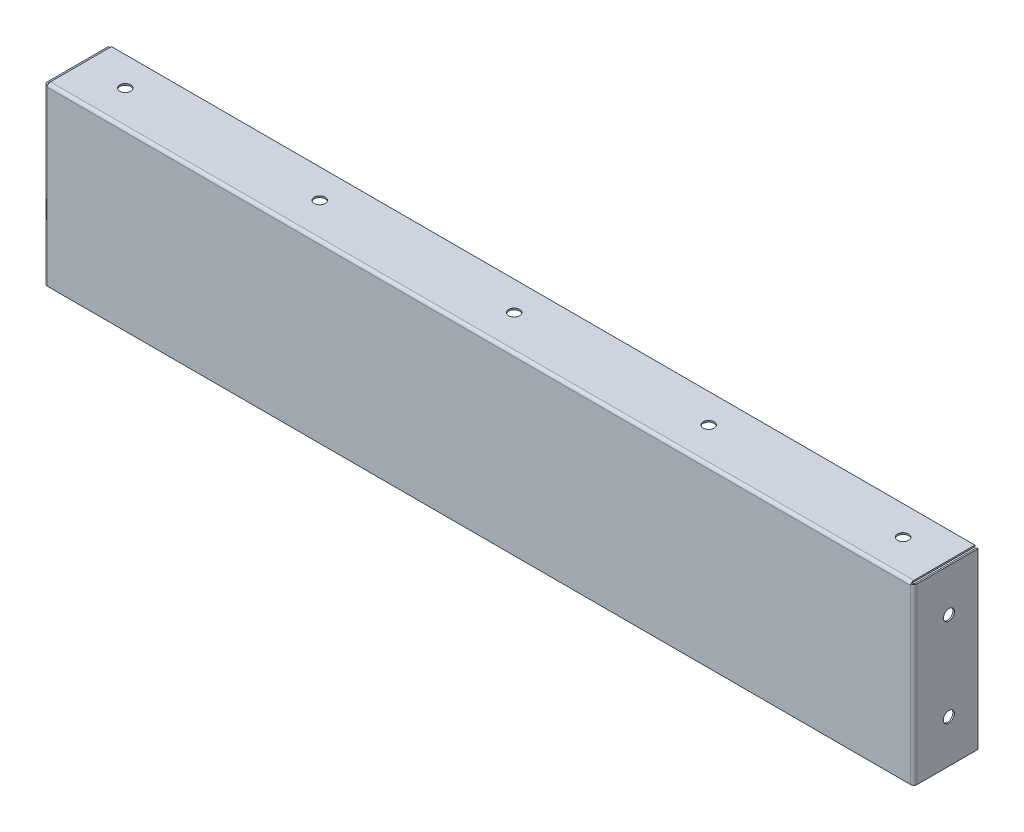
ISO-10303-21;
HEADER;
FILE_DESCRIPTION(('STEP AP214'),'2;1');
FILE_NAME('part.step','',(''),(''),'','','');
FILE_SCHEMA(('AUTOMOTIVE_DESIGN { 1 0 10303 214 1 1 1 1 }'));
ENDSEC;
DATA;
#1=APPLICATION_CONTEXT('core data for automotive mechanical design processes');
#2=APPLICATION_PROTOCOL_DEFINITION('international standard','automotive_design',2000,#1);
#3=PRODUCT_CONTEXT('',#1,'mechanical');
#4=PRODUCT('Part','Part','',(#3));
#5=PRODUCT_RELATED_PRODUCT_CATEGORY('part','',(#4));
#6=PRODUCT_DEFINITION_FORMATION('','',#4);
#7=PRODUCT_DEFINITION_CONTEXT('part definition',#1,'design');
#8=PRODUCT_DEFINITION('design','',#6,#7);
#9=PRODUCT_DEFINITION_SHAPE('','',#8);
#10=(LENGTH_UNIT() NAMED_UNIT(*) SI_UNIT(.MILLI.,.METRE.));
#11=(NAMED_UNIT(*) PLANE_ANGLE_UNIT() SI_UNIT($,.RADIAN.));
#12=(NAMED_UNIT(*) SI_UNIT($,.STERADIAN.) SOLID_ANGLE_UNIT());
#13=UNCERTAINTY_MEASURE_WITH_UNIT(LENGTH_MEASURE(1.E-05),#10,'distance_accuracy_value','');
#14=(GEOMETRIC_REPRESENTATION_CONTEXT(3) GLOBAL_UNCERTAINTY_ASSIGNED_CONTEXT((#13)) GLOBAL_UNIT_ASSIGNED_CONTEXT((#10,
#11,#12)) REPRESENTATION_CONTEXT('',''));
#15=CARTESIAN_POINT('',(0.,0.,0.));
#16=DIRECTION('',(0.,0.,1.));
#17=DIRECTION('',(1.,0.,0.));
#18=AXIS2_PLACEMENT_3D('',#15,#16,#17);
#19=CARTESIAN_POINT('',(256.286,51.6000999999999,0.685800000000012));
#20=DIRECTION('',(-1.,0.,0.));
#21=DIRECTION('',(0.,-1.,0.));
#22=AXIS2_PLACEMENT_3D('',#19,#20,#21);
#23=PLANE('',#22);
#24=DIRECTION('',(0.,0.,1.));
#25=VECTOR('',#24,1.);
#26=CARTESIAN_POINT('',(256.286,51.6000999999999,0.685800000000012));
#27=LINE('',#26,#25);
#28=CARTESIAN_POINT('',(256.286,51.6000999999999,1.35518725844096));
#29=VERTEX_POINT('',#28);
#30=CARTESIAN_POINT('',(256.286,51.6000999999999,1.60020000000001));
#31=VERTEX_POINT('',#30);
#32=EDGE_CURVE('E55',#29,#31,#27,.T.);
#33=ORIENTED_EDGE('',*,*,#32,.F.);
#34=CARTESIAN_POINT('',(256.286,50.6856999999999,-0.228599999999999));
#35=DIRECTION('',(1.,0.,0.));
#36=DIRECTION('',(0.,0.,-1.));
#37=AXIS2_PLACEMENT_3D('',#34,#35,#36);
#38=CIRCLE('',#37,1.82879999999998);
#39=CARTESIAN_POINT('',(256.286,50.6856999999999,1.60020000000001));
#40=VERTEX_POINT('',#39);
#41=EDGE_CURVE('E11',#29,#40,#38,.T.);
#42=ORIENTED_EDGE('',*,*,#41,.T.);
#43=DIRECTION('',(0.,-1.,0.));
#44=VECTOR('',#43,1.);
#45=CARTESIAN_POINT('',(256.285999999994,-51.6000999999999,1.60020000000001));
#46=LINE('',#45,#44);
#47=EDGE_CURVE('E238',#31,#40,#46,.T.);
#48=ORIENTED_EDGE('',*,*,#47,.F.);
#49=EDGE_LOOP('',(#33,#42,#48));
#50=FACE_BOUND('',#49,.T.);
#51=ADVANCED_FACE('F38',(#50),#23,.T.);
#52=CARTESIAN_POINT('',(-256.286,50.6856999999999,0.685799999999998));
#53=DIRECTION('',(1.,3.64246399155242E-13,0.));
#54=DIRECTION('',(-3.64246399155242E-13,1.,0.));
#55=AXIS2_PLACEMENT_3D('',#52,#53,#54);
#56=PLANE('',#55);
#57=DIRECTION('',(0.,1.,0.));
#58=VECTOR('',#57,1.);
#59=CARTESIAN_POINT('',(-256.286,51.6000999999999,1.60020000000001));
#60=LINE('',#59,#58);
#61=CARTESIAN_POINT('',(-256.286,51.6000999999999,1.60020000000001));
#62=VERTEX_POINT('',#61);
#63=CARTESIAN_POINT('',(-256.286,50.6856999999999,1.60020000000001));
#64=VERTEX_POINT('',#63);
#65=EDGE_CURVE('E292',#62,#64,#60,.F.);
#66=ORIENTED_EDGE('',*,*,#65,.T.);
#67=CARTESIAN_POINT('',(-256.286,50.6856999999999,-0.228599999999984));
#68=DIRECTION('',(1.,0.,0.));
#69=DIRECTION('',(0.,0.,-1.));
#70=AXIS2_PLACEMENT_3D('',#67,#68,#69);
#71=CIRCLE('',#70,1.82879999999998);
#72=CARTESIAN_POINT('',(-256.286,51.6000999999999,1.35518725844099));
#73=VERTEX_POINT('',#72);
#74=EDGE_CURVE('E227',#64,#73,#71,.F.);
#75=ORIENTED_EDGE('',*,*,#74,.T.);
#76=DIRECTION('',(0.,0.,1.));
#77=VECTOR('',#76,1.);
#78=CARTESIAN_POINT('',(-256.286,51.6000999999999,0.685800000000012));
#79=LINE('',#78,#77);
#80=EDGE_CURVE('E298',#73,#62,#79,.T.);
#81=ORIENTED_EDGE('',*,*,#80,.T.);
#82=EDGE_LOOP('',(#66,#75,#81));
#83=FACE_BOUND('',#82,.T.);
#84=ADVANCED_FACE('F441',(#83),#56,.T.);
#85=CARTESIAN_POINT('',(0.,0.,1.6002));
#86=DIRECTION('',(0.,0.,-1.));
#87=DIRECTION('',(-1.,0.,0.));
#88=AXIS2_PLACEMENT_3D('',#85,#86,#87);
#89=PLANE('',#88);
#90=DIRECTION('',(1.,0.,0.));
#91=VECTOR('',#90,1.);
#92=CARTESIAN_POINT('',(256.286,50.6856999999999,1.60019999999998));
#93=LINE('',#92,#91);
#94=EDGE_CURVE('E181',#40,#64,#93,.F.);
#95=ORIENTED_EDGE('',*,*,#94,.T.);
#96=CARTESIAN_POINT('',(-256.286,-51.6000999999999,1.6002));
#97=VERTEX_POINT('',#96);
#98=EDGE_CURVE('E295',#64,#97,#60,.F.);
#99=ORIENTED_EDGE('',*,*,#98,.T.);
#100=DIRECTION('',(1.,0.,0.));
#101=VECTOR('',#100,1.);
#102=CARTESIAN_POINT('',(-257.2004,-51.6000999999999,1.6002));
#103=LINE('',#102,#101);
#104=CARTESIAN_POINT('',(256.286,-51.6000999999999,1.60020000000001));
#105=VERTEX_POINT('',#104);
#106=EDGE_CURVE('E47',#97,#105,#103,.T.);
#107=ORIENTED_EDGE('',*,*,#106,.T.);
#108=DIRECTION('',(0.,-1.,0.));
#109=VECTOR('',#108,1.);
#110=CARTESIAN_POINT('',(256.286,-51.6000999999999,1.60020000000001));
#111=LINE('',#110,#109);
#112=EDGE_CURVE('E346',#105,#40,#111,.F.);
#113=ORIENTED_EDGE('',*,*,#112,.T.);
#114=EDGE_LOOP('',(#95,#99,#107,#113));
#115=FACE_BOUND('',#114,.T.);
#116=ADVANCED_FACE('F446',(#115),#89,.F.);
#117=CARTESIAN_POINT('',(0.,0.,0.6858));
#118=DIRECTION('',(0.,0.,-1.));
#119=DIRECTION('',(-1.,0.,0.));
#120=AXIS2_PLACEMENT_3D('',#117,#118,#119);
#121=PLANE('',#120);
#122=DIRECTION('',(0.,1.,0.));
#123=VECTOR('',#122,1.);
#124=CARTESIAN_POINT('',(-256.286,51.6000999999999,0.685800000000012));
#125=LINE('',#124,#123);
#126=CARTESIAN_POINT('',(-256.286,50.6856999999999,0.685800000000012));
#127=VERTEX_POINT('',#126);
#128=CARTESIAN_POINT('',(-256.286,-51.6000999999999,0.685800000000012));
#129=VERTEX_POINT('',#128);
#130=EDGE_CURVE('E63',#127,#129,#125,.F.);
#131=ORIENTED_EDGE('',*,*,#130,.F.);
#132=DIRECTION('',(1.,0.,0.));
#133=VECTOR('',#132,1.);
#134=CARTESIAN_POINT('',(256.286,50.6856999999999,0.685799999999982));
#135=LINE('',#134,#133);
#136=CARTESIAN_POINT('',(256.286,50.6856999999999,0.685799999999982));
#137=VERTEX_POINT('',#136);
#138=EDGE_CURVE('E233',#137,#127,#135,.F.);
#139=ORIENTED_EDGE('',*,*,#138,.F.);
#140=DIRECTION('',(0.,-1.,0.));
#141=VECTOR('',#140,1.);
#142=CARTESIAN_POINT('',(256.286,-51.6000999999999,0.685800000000012));
#143=LINE('',#142,#141);
#144=CARTESIAN_POINT('',(256.286,-51.6000999999999,0.6858));
#145=VERTEX_POINT('',#144);
#146=EDGE_CURVE('E359',#145,#137,#143,.F.);
#147=ORIENTED_EDGE('',*,*,#146,.F.);
#148=DIRECTION('',(-1.,0.,0.));
#149=VECTOR('',#148,1.);
#150=CARTESIAN_POINT('',(0.,-51.6000999999999,0.6858));
#151=LINE('',#150,#149);
#152=EDGE_CURVE('E366',#129,#145,#151,.F.);
#153=ORIENTED_EDGE('',*,*,#152,.F.);
#154=EDGE_LOOP('',(#131,#139,#147,#153));
#155=FACE_BOUND('',#154,.T.);
#156=ADVANCED_FACE('F534',(#155),#121,.T.);
#157=CARTESIAN_POINT('',(-257.2004,-51.6000999999999,1.6002));
#158=DIRECTION('',(0.,1.,0.));
#159=DIRECTION('',(1.,0.,0.));
#160=AXIS2_PLACEMENT_3D('',#157,#158,#159);
#161=PLANE('',#160);
#162=DIRECTION('',(0.,0.,1.));
#163=VECTOR('',#162,1.);
#164=CARTESIAN_POINT('',(-256.286,-51.6000999999999,0.685800000000012));
#165=LINE('',#164,#163);
#166=EDGE_CURVE('E309',#129,#97,#165,.T.);
#167=ORIENTED_EDGE('',*,*,#166,.F.);
#168=ORIENTED_EDGE('',*,*,#152,.T.);
#169=DIRECTION('',(0.,0.,1.));
#170=VECTOR('',#169,1.);
#171=CARTESIAN_POINT('',(256.286,-51.6000999999999,0.685800000000012));
#172=LINE('',#171,#170);
#173=EDGE_CURVE('E353',#145,#105,#172,.T.);
#174=ORIENTED_EDGE('',*,*,#173,.T.);
#175=ORIENTED_EDGE('',*,*,#106,.F.);
#176=EDGE_LOOP('',(#167,#168,#174,#175));
#177=FACE_BOUND('',#176,.T.);
#178=ADVANCED_FACE('F40',(#177),#161,.F.);
#179=CARTESIAN_POINT('',(256.286,51.6000999999999,-0.22859999999997));
#180=DIRECTION('',(0.,1.,0.));
#181=DIRECTION('',(0.,0.,1.));
#182=AXIS2_PLACEMENT_3D('',#179,#180,#181);
#183=PLANE('',#182);
#184=DIRECTION('',(1.,0.,0.));
#185=VECTOR('',#184,1.);
#186=CARTESIAN_POINT('',(257.2004,51.6000999999999,-0.228599999999968));
#187=LINE('',#186,#185);
#188=CARTESIAN_POINT('',(257.2004,51.6000999999999,-0.228599999999968));
#189=VERTEX_POINT('',#188);
#190=CARTESIAN_POINT('',(258.1148,51.6000999999999,-0.228599999999965));
#191=VERTEX_POINT('',#190);
#192=EDGE_CURVE('E312',#189,#191,#187,.T.);
#193=ORIENTED_EDGE('',*,*,#192,.F.);
#194=CARTESIAN_POINT('',(256.286,51.6000999999999,-0.22859999999997));
#195=DIRECTION('',(0.,-1.,0.));
#196=DIRECTION('',(0.,0.,-1.));
#197=AXIS2_PLACEMENT_3D('',#194,#195,#196);
#198=CIRCLE('',#197,0.914399999999982);
#199=CARTESIAN_POINT('',(256.286,51.6000999999999,0.685800000000012));
#200=VERTEX_POINT('',#199);
#201=EDGE_CURVE('E356',#200,#189,#198,.F.);
#202=ORIENTED_EDGE('',*,*,#201,.F.);
#203=EDGE_CURVE('E364',#200,#29,#27,.T.);
#204=ORIENTED_EDGE('',*,*,#203,.T.);
#205=ORIENTED_EDGE('',*,*,#32,.T.);
#206=CARTESIAN_POINT('',(256.286,51.6000999999999,-0.22859999999997));
#207=DIRECTION('',(0.,-1.,0.));
#208=DIRECTION('',(0.,0.,-1.));
#209=AXIS2_PLACEMENT_3D('',#206,#207,#208);
#210=CIRCLE('',#209,1.82879999999998);
#211=EDGE_CURVE('E349',#31,#191,#210,.F.);
#212=ORIENTED_EDGE('',*,*,#211,.T.);
#213=EDGE_LOOP('',(#193,#202,#204,#205,#212));
#214=FACE_BOUND('',#213,.T.);
#215=ADVANCED_FACE('F526',(#214),#183,.T.);
#216=CARTESIAN_POINT('',(256.286,-51.6000999999999,-0.22859999999997));
#217=DIRECTION('',(0.,1.,0.));
#218=DIRECTION('',(0.,0.,1.));
#219=AXIS2_PLACEMENT_3D('',#216,#217,#218);
#220=PLANE('',#219);
#221=CARTESIAN_POINT('',(256.286,-51.6000999999999,-0.22859999999997));
#222=DIRECTION('',(0.,-1.,0.));
#223=DIRECTION('',(0.,0.,-1.));
#224=AXIS2_PLACEMENT_3D('',#221,#222,#223);
#225=CIRCLE('',#224,0.914399999999982);
#226=CARTESIAN_POINT('',(257.2004,-51.6000999999999,-0.228599999999968));
#227=VERTEX_POINT('',#226);
#228=EDGE_CURVE('E345',#227,#145,#225,.T.);
#229=ORIENTED_EDGE('',*,*,#228,.F.);
#230=DIRECTION('',(1.,0.,0.));
#231=VECTOR('',#230,1.);
#232=CARTESIAN_POINT('',(257.2004,-51.6000999999999,-0.228599999999968));
#233=LINE('',#232,#231);
#234=CARTESIAN_POINT('',(258.1148,-51.6000999999999,-0.228599999999965));
#235=VERTEX_POINT('',#234);
#236=EDGE_CURVE('E318',#227,#235,#233,.T.);
#237=ORIENTED_EDGE('',*,*,#236,.T.);
#238=CARTESIAN_POINT('',(256.286,-51.6000999999999,-0.22859999999997));
#239=DIRECTION('',(0.,-1.,0.));
#240=DIRECTION('',(0.,0.,-1.));
#241=AXIS2_PLACEMENT_3D('',#238,#239,#240);
#242=CIRCLE('',#241,1.82879999999998);
#243=EDGE_CURVE('E350',#235,#105,#242,.T.);
#244=ORIENTED_EDGE('',*,*,#243,.T.);
#245=ORIENTED_EDGE('',*,*,#173,.F.);
#246=EDGE_LOOP('',(#229,#237,#244,#245));
#247=FACE_BOUND('',#246,.T.);
#248=ADVANCED_FACE('F521',(#247),#220,.F.);
#249=CARTESIAN_POINT('',(256.286,-51.6000999999999,-0.22859999999997));
#250=DIRECTION('',(0.,-1.,0.));
#251=DIRECTION('',(1.,0.,0.));
#252=AXIS2_PLACEMENT_3D('',#249,#250,#251);
#253=CYLINDRICAL_SURFACE('',#252,1.82879999999998);
#254=ORIENTED_EDGE('',*,*,#112,.F.);
#255=ORIENTED_EDGE('',*,*,#243,.F.);
#256=DIRECTION('',(0.,1.,0.));
#257=VECTOR('',#256,1.);
#258=CARTESIAN_POINT('',(258.1148,0.,-0.228599999999965));
#259=LINE('',#258,#257);
#260=EDGE_CURVE('E321',#235,#191,#259,.T.);
#261=ORIENTED_EDGE('',*,*,#260,.T.);
#262=ORIENTED_EDGE('',*,*,#211,.F.);
#263=ORIENTED_EDGE('',*,*,#47,.T.);
#264=EDGE_LOOP('',(#254,#255,#261,#262,#263));
#265=FACE_BOUND('',#264,.T.);
#266=ADVANCED_FACE('F518',(#265),#253,.T.);
#267=CARTESIAN_POINT('',(256.286,-51.6000999999999,-0.22859999999997));
#268=DIRECTION('',(0.,-1.,0.));
#269=DIRECTION('',(1.,0.,0.));
#270=AXIS2_PLACEMENT_3D('',#267,#268,#269);
#271=CYLINDRICAL_SURFACE('',#270,0.914399999999982);
#272=ORIENTED_EDGE('',*,*,#146,.T.);
#273=DIRECTION('',(0.,-1.,0.));
#274=VECTOR('',#273,1.);
#275=CARTESIAN_POINT('',(256.286,51.6000999999999,0.685800000000012));
#276=LINE('',#275,#274);
#277=EDGE_CURVE('E229',#200,#137,#276,.T.);
#278=ORIENTED_EDGE('',*,*,#277,.F.);
#279=ORIENTED_EDGE('',*,*,#201,.T.);
#280=DIRECTION('',(0.,-1.,0.));
#281=VECTOR('',#280,1.);
#282=CARTESIAN_POINT('',(257.2004,51.6000999999999,-0.228599999999968));
#283=LINE('',#282,#281);
#284=EDGE_CURVE('E316',#189,#227,#283,.T.);
#285=ORIENTED_EDGE('',*,*,#284,.T.);
#286=ORIENTED_EDGE('',*,*,#228,.T.);
#287=EDGE_LOOP('',(#272,#278,#279,#285,#286));
#288=FACE_BOUND('',#287,.T.);
#289=ADVANCED_FACE('F516',(#288),#271,.F.);
#290=CARTESIAN_POINT('',(258.1148,-51.6000999999999,-36.4998));
#291=DIRECTION('',(0.,1.,0.));
#292=DIRECTION('',(0.,0.,1.));
#293=AXIS2_PLACEMENT_3D('',#290,#291,#292);
#294=PLANE('',#293);
#295=ORIENTED_EDGE('',*,*,#236,.F.);
#296=DIRECTION('',(0.,0.,-1.));
#297=VECTOR('',#296,1.);
#298=CARTESIAN_POINT('',(257.2004,-51.6000999999999,-36.4998));
#299=LINE('',#298,#297);
#300=CARTESIAN_POINT('',(257.2004,-51.6000999999999,-36.4998));
#301=VERTEX_POINT('',#300);
#302=EDGE_CURVE('E325',#227,#301,#299,.T.);
#303=ORIENTED_EDGE('',*,*,#302,.T.);
#304=DIRECTION('',(-1.,0.,0.));
#305=VECTOR('',#304,1.);
#306=CARTESIAN_POINT('',(258.1148,-51.6000999999999,-36.4998));
#307=LINE('',#306,#305);
#308=CARTESIAN_POINT('',(258.1148,-51.6000999999999,-36.4998));
#309=VERTEX_POINT('',#308);
#310=EDGE_CURVE('E342',#309,#301,#307,.T.);
#311=ORIENTED_EDGE('',*,*,#310,.F.);
#312=DIRECTION('',(0.,0.,-1.));
#313=VECTOR('',#312,1.);
#314=CARTESIAN_POINT('',(258.1148,-51.6000999999999,-36.4998));
#315=LINE('',#314,#313);
#316=EDGE_CURVE('E326',#235,#309,#315,.T.);
#317=ORIENTED_EDGE('',*,*,#316,.F.);
#318=EDGE_LOOP('',(#295,#303,#311,#317));
#319=FACE_BOUND('',#318,.T.);
#320=ADVANCED_FACE('F509',(#319),#294,.F.);
#321=CARTESIAN_POINT('',(258.1148,51.6000999999999,0.685800000000003));
#322=DIRECTION('',(0.,-1.,0.));
#323=DIRECTION('',(0.,0.,-1.));
#324=AXIS2_PLACEMENT_3D('',#321,#322,#323);
#325=PLANE('',#324);
#326=ORIENTED_EDGE('',*,*,#192,.T.);
#327=DIRECTION('',(0.,0.,1.));
#328=VECTOR('',#327,1.);
#329=CARTESIAN_POINT('',(258.1148,51.6000999999999,0.685800000000003));
#330=LINE('',#329,#328);
#331=CARTESIAN_POINT('',(258.1148,51.6000999999999,-36.4998));
#332=VERTEX_POINT('',#331);
#333=EDGE_CURVE('E331',#332,#191,#330,.T.);
#334=ORIENTED_EDGE('',*,*,#333,.F.);
#335=DIRECTION('',(-1.,0.,0.));
#336=VECTOR('',#335,1.);
#337=CARTESIAN_POINT('',(258.1148,51.6000999999999,-36.4998));
#338=LINE('',#337,#336);
#339=CARTESIAN_POINT('',(257.2004,51.6000999999999,-36.4998));
#340=VERTEX_POINT('',#339);
#341=EDGE_CURVE('E334',#332,#340,#338,.T.);
#342=ORIENTED_EDGE('',*,*,#341,.T.);
#343=DIRECTION('',(0.,0.,1.));
#344=VECTOR('',#343,1.);
#345=CARTESIAN_POINT('',(257.2004,51.6000999999999,0.6858));
#346=LINE('',#345,#344);
#347=EDGE_CURVE('E329',#340,#189,#346,.T.);
#348=ORIENTED_EDGE('',*,*,#347,.T.);
#349=EDGE_LOOP('',(#326,#334,#342,#348));
#350=FACE_BOUND('',#349,.T.);
#351=ADVANCED_FACE('F502',(#350),#325,.F.);
#352=CARTESIAN_POINT('',(258.1148,0.,7.71096869235304E-13));
#353=DIRECTION('',(-1.,0.,0.));
#354=DIRECTION('',(0.,0.,1.));
#355=AXIS2_PLACEMENT_3D('',#352,#353,#354);
#356=PLANE('',#355);
#357=CARTESIAN_POINT('',(258.1148,26.2000999999999,-19.2447292607018));
#358=DIRECTION('',(-1.,0.,0.));
#359=DIRECTION('',(0.,0.,1.));
#360=AXIS2_PLACEMENT_3D('',#357,#358,#359);
#361=CIRCLE('',#360,3.2639);
#362=CARTESIAN_POINT('',(258.1148,26.2000999999999,-15.9808292607018));
#363=VERTEX_POINT('',#362);
#364=EDGE_CURVE('E242',#363,#363,#361,.T.);
#365=ORIENTED_EDGE('',*,*,#364,.T.);
#366=EDGE_LOOP('',(#365));
#367=FACE_BOUND('',#366,.T.);
#368=CARTESIAN_POINT('',(258.1148,-26.2000999999999,-19.2447292607018));
#369=DIRECTION('',(-1.,0.,0.));
#370=DIRECTION('',(0.,0.,1.));
#371=AXIS2_PLACEMENT_3D('',#368,#369,#370);
#372=CIRCLE('',#371,3.2639);
#373=CARTESIAN_POINT('',(258.1148,-26.2000999999999,-15.9808292607018));
#374=VERTEX_POINT('',#373);
#375=EDGE_CURVE('E241',#374,#374,#372,.T.);
#376=ORIENTED_EDGE('',*,*,#375,.T.);
#377=EDGE_LOOP('',(#376));
#378=FACE_BOUND('',#377,.T.);
#379=ORIENTED_EDGE('',*,*,#260,.F.);
#380=ORIENTED_EDGE('',*,*,#316,.T.);
#381=DIRECTION('',(0.,1.,0.));
#382=VECTOR('',#381,1.);
#383=CARTESIAN_POINT('',(258.1148,51.6000999999999,-36.4998));
#384=LINE('',#383,#382);
#385=EDGE_CURVE('E328',#309,#332,#384,.T.);
#386=ORIENTED_EDGE('',*,*,#385,.T.);
#387=ORIENTED_EDGE('',*,*,#333,.T.);
#388=EDGE_LOOP('',(#379,#380,#386,#387));
#389=FACE_BOUND('',#388,.T.);
#390=ADVANCED_FACE('F498',(#367,#378,#389),#356,.F.);
#391=CARTESIAN_POINT('',(257.2004,0.,7.67904258699066E-13));
#392=DIRECTION('',(-1.,0.,0.));
#393=DIRECTION('',(0.,0.,1.));
#394=AXIS2_PLACEMENT_3D('',#391,#392,#393);
#395=PLANE('',#394);
#396=CARTESIAN_POINT('',(257.2004,26.2000999999999,-19.2447292607018));
#397=DIRECTION('',(-1.,0.,0.));
#398=DIRECTION('',(0.,0.,1.));
#399=AXIS2_PLACEMENT_3D('',#396,#397,#398);
#400=CIRCLE('',#399,3.2639);
#401=CARTESIAN_POINT('',(257.2004,26.2000999999999,-15.9808292607018));
#402=VERTEX_POINT('',#401);
#403=EDGE_CURVE('E258',#402,#402,#400,.T.);
#404=ORIENTED_EDGE('',*,*,#403,.F.);
#405=EDGE_LOOP('',(#404));
#406=FACE_BOUND('',#405,.T.);
#407=CARTESIAN_POINT('',(257.2004,-26.2000999999999,-19.2447292607018));
#408=DIRECTION('',(-1.,0.,0.));
#409=DIRECTION('',(0.,0.,1.));
#410=AXIS2_PLACEMENT_3D('',#407,#408,#409);
#411=CIRCLE('',#410,3.2639);
#412=CARTESIAN_POINT('',(257.2004,-26.2000999999999,-15.9808292607018));
#413=VERTEX_POINT('',#412);
#414=EDGE_CURVE('E251',#413,#413,#411,.T.);
#415=ORIENTED_EDGE('',*,*,#414,.F.);
#416=EDGE_LOOP('',(#415));
#417=FACE_BOUND('',#416,.T.);
#418=ORIENTED_EDGE('',*,*,#302,.F.);
#419=ORIENTED_EDGE('',*,*,#284,.F.);
#420=ORIENTED_EDGE('',*,*,#347,.F.);
#421=DIRECTION('',(0.,1.,0.));
#422=VECTOR('',#421,1.);
#423=CARTESIAN_POINT('',(257.2004,51.6000999999999,-36.4998));
#424=LINE('',#423,#422);
#425=EDGE_CURVE('E336',#301,#340,#424,.T.);
#426=ORIENTED_EDGE('',*,*,#425,.F.);
#427=EDGE_LOOP('',(#418,#419,#420,#426));
#428=FACE_BOUND('',#427,.T.);
#429=ADVANCED_FACE('F501',(#406,#417,#428),#395,.T.);
#430=CARTESIAN_POINT('',(258.1148,51.6000999999999,-36.4998));
#431=DIRECTION('',(0.,0.,1.));
#432=DIRECTION('',(1.,0.,0.));
#433=AXIS2_PLACEMENT_3D('',#430,#431,#432);
#434=PLANE('',#433);
#435=ORIENTED_EDGE('',*,*,#425,.T.);
#436=ORIENTED_EDGE('',*,*,#341,.F.);
#437=ORIENTED_EDGE('',*,*,#385,.F.);
#438=ORIENTED_EDGE('',*,*,#310,.T.);
#439=EDGE_LOOP('',(#435,#436,#437,#438));
#440=FACE_BOUND('',#439,.T.);
#441=ADVANCED_FACE('F493',(#440),#434,.F.);
#442=CARTESIAN_POINT('',(-256.286,-51.6000999999999,-0.22859999999997));
#443=DIRECTION('',(0.,-1.,0.));
#444=DIRECTION('',(0.,0.,-1.));
#445=AXIS2_PLACEMENT_3D('',#442,#443,#444);
#446=PLANE('',#445);
#447=DIRECTION('',(-1.,0.,0.));
#448=VECTOR('',#447,1.);
#449=CARTESIAN_POINT('',(-257.2004,-51.6000999999999,-0.228599999999968));
#450=LINE('',#449,#448);
#451=CARTESIAN_POINT('',(-257.2004,-51.6000999999999,-0.228599999999968));
#452=VERTEX_POINT('',#451);
#453=CARTESIAN_POINT('',(-258.1148,-51.6000999999999,-0.228599999999965));
#454=VERTEX_POINT('',#453);
#455=EDGE_CURVE('E261',#452,#454,#450,.T.);
#456=ORIENTED_EDGE('',*,*,#455,.F.);
#457=CARTESIAN_POINT('',(-256.286,-51.6000999999999,-0.22859999999997));
#458=DIRECTION('',(0.,1.,0.));
#459=DIRECTION('',(0.,0.,1.));
#460=AXIS2_PLACEMENT_3D('',#457,#458,#459);
#461=CIRCLE('',#460,0.914399999999982);
#462=EDGE_CURVE('E302',#129,#452,#461,.F.);
#463=ORIENTED_EDGE('',*,*,#462,.F.);
#464=ORIENTED_EDGE('',*,*,#166,.T.);
#465=CARTESIAN_POINT('',(-256.286,-51.6000999999999,-0.22859999999997));
#466=DIRECTION('',(0.,1.,0.));
#467=DIRECTION('',(0.,0.,1.));
#468=AXIS2_PLACEMENT_3D('',#465,#466,#467);
#469=CIRCLE('',#468,1.82879999999998);
#470=EDGE_CURVE('E294',#97,#454,#469,.F.);
#471=ORIENTED_EDGE('',*,*,#470,.T.);
#472=EDGE_LOOP('',(#456,#463,#464,#471));
#473=FACE_BOUND('',#472,.T.);
#474=ADVANCED_FACE('F490',(#473),#446,.T.);
#475=CARTESIAN_POINT('',(-256.286,51.6000999999999,-0.22859999999997));
#476=DIRECTION('',(0.,-1.,0.));
#477=DIRECTION('',(0.,0.,-1.));
#478=AXIS2_PLACEMENT_3D('',#475,#476,#477);
#479=PLANE('',#478);
#480=CARTESIAN_POINT('',(-256.286,51.6000999999999,-0.22859999999997));
#481=DIRECTION('',(0.,1.,0.));
#482=DIRECTION('',(0.,0.,1.));
#483=AXIS2_PLACEMENT_3D('',#480,#481,#482);
#484=CIRCLE('',#483,0.914399999999982);
#485=CARTESIAN_POINT('',(-257.2004,51.6000999999999,-0.228599999999968));
#486=VERTEX_POINT('',#485);
#487=CARTESIAN_POINT('',(-256.286,51.6000999999999,0.685800000000012));
#488=VERTEX_POINT('',#487);
#489=EDGE_CURVE('E291',#486,#488,#484,.T.);
#490=ORIENTED_EDGE('',*,*,#489,.F.);
#491=DIRECTION('',(-1.,0.,0.));
#492=VECTOR('',#491,1.);
#493=CARTESIAN_POINT('',(-257.2004,51.6000999999999,-0.228599999999968));
#494=LINE('',#493,#492);
#495=CARTESIAN_POINT('',(-258.1148,51.6000999999999,-0.228599999999965));
#496=VERTEX_POINT('',#495);
#497=EDGE_CURVE('E264',#486,#496,#494,.T.);
#498=ORIENTED_EDGE('',*,*,#497,.T.);
#499=CARTESIAN_POINT('',(-256.286,51.6000999999999,-0.22859999999997));
#500=DIRECTION('',(0.,1.,0.));
#501=DIRECTION('',(0.,0.,1.));
#502=AXIS2_PLACEMENT_3D('',#499,#500,#501);
#503=CIRCLE('',#502,1.82879999999998);
#504=EDGE_CURVE('E299',#496,#62,#503,.T.);
#505=ORIENTED_EDGE('',*,*,#504,.T.);
#506=ORIENTED_EDGE('',*,*,#80,.F.);
#507=EDGE_CURVE('E313',#488,#73,#79,.T.);
#508=ORIENTED_EDGE('',*,*,#507,.F.);
#509=EDGE_LOOP('',(#490,#498,#505,#506,#508));
#510=FACE_BOUND('',#509,.T.);
#511=ADVANCED_FACE('F485',(#510),#479,.F.);
#512=CARTESIAN_POINT('',(-256.286,51.6000999999999,-0.22859999999997));
#513=DIRECTION('',(0.,1.,0.));
#514=DIRECTION('',(-1.,0.,0.));
#515=AXIS2_PLACEMENT_3D('',#512,#513,#514);
#516=CYLINDRICAL_SURFACE('',#515,1.82879999999998);
#517=ORIENTED_EDGE('',*,*,#65,.F.);
#518=ORIENTED_EDGE('',*,*,#504,.F.);
#519=DIRECTION('',(0.,-1.,0.));
#520=VECTOR('',#519,1.);
#521=CARTESIAN_POINT('',(-258.1148,0.,-0.228599999999965));
#522=LINE('',#521,#520);
#523=EDGE_CURVE('E267',#496,#454,#522,.T.);
#524=ORIENTED_EDGE('',*,*,#523,.T.);
#525=ORIENTED_EDGE('',*,*,#470,.F.);
#526=ORIENTED_EDGE('',*,*,#98,.F.);
#527=EDGE_LOOP('',(#517,#518,#524,#525,#526));
#528=FACE_BOUND('',#527,.T.);
#529=ADVANCED_FACE('F482',(#528),#516,.T.);
#530=CARTESIAN_POINT('',(-256.286,51.6000999999999,-0.22859999999997));
#531=DIRECTION('',(0.,1.,0.));
#532=DIRECTION('',(-1.,0.,0.));
#533=AXIS2_PLACEMENT_3D('',#530,#531,#532);
#534=CYLINDRICAL_SURFACE('',#533,0.914399999999982);
#535=EDGE_CURVE('E305',#488,#127,#125,.F.);
#536=ORIENTED_EDGE('',*,*,#535,.T.);
#537=ORIENTED_EDGE('',*,*,#130,.T.);
#538=ORIENTED_EDGE('',*,*,#462,.T.);
#539=DIRECTION('',(0.,1.,0.));
#540=VECTOR('',#539,1.);
#541=CARTESIAN_POINT('',(-257.2004,-51.6000999999999,-0.228599999999968));
#542=LINE('',#541,#540);
#543=EDGE_CURVE('E262',#452,#486,#542,.T.);
#544=ORIENTED_EDGE('',*,*,#543,.T.);
#545=ORIENTED_EDGE('',*,*,#489,.T.);
#546=EDGE_LOOP('',(#536,#537,#538,#544,#545));
#547=FACE_BOUND('',#546,.T.);
#548=ADVANCED_FACE('F480',(#547),#534,.F.);
#549=CARTESIAN_POINT('',(-258.1148,51.6000999999999,-36.4998));
#550=DIRECTION('',(0.,-1.,0.));
#551=DIRECTION('',(0.,0.,-1.));
#552=AXIS2_PLACEMENT_3D('',#549,#550,#551);
#553=PLANE('',#552);
#554=ORIENTED_EDGE('',*,*,#497,.F.);
#555=DIRECTION('',(0.,0.,-1.));
#556=VECTOR('',#555,1.);
#557=CARTESIAN_POINT('',(-257.2004,51.6000999999999,-36.4998));
#558=LINE('',#557,#556);
#559=CARTESIAN_POINT('',(-257.2004,51.6000999999999,-36.4998));
#560=VERTEX_POINT('',#559);
#561=EDGE_CURVE('E271',#486,#560,#558,.T.);
#562=ORIENTED_EDGE('',*,*,#561,.T.);
#563=DIRECTION('',(1.,0.,0.));
#564=VECTOR('',#563,1.);
#565=CARTESIAN_POINT('',(-258.1148,51.6000999999999,-36.4998));
#566=LINE('',#565,#564);
#567=CARTESIAN_POINT('',(-258.1148,51.6000999999999,-36.4998));
#568=VERTEX_POINT('',#567);
#569=EDGE_CURVE('E288',#568,#560,#566,.T.);
#570=ORIENTED_EDGE('',*,*,#569,.F.);
#571=DIRECTION('',(0.,0.,-1.));
#572=VECTOR('',#571,1.);
#573=CARTESIAN_POINT('',(-258.1148,51.6000999999999,-36.4998));
#574=LINE('',#573,#572);
#575=EDGE_CURVE('E272',#496,#568,#574,.T.);
#576=ORIENTED_EDGE('',*,*,#575,.F.);
#577=EDGE_LOOP('',(#554,#562,#570,#576));
#578=FACE_BOUND('',#577,.T.);
#579=ADVANCED_FACE('F473',(#578),#553,.F.);
#580=CARTESIAN_POINT('',(-258.1148,-51.6000999999999,0.685800000000003));
#581=DIRECTION('',(0.,1.,0.));
#582=DIRECTION('',(0.,0.,1.));
#583=AXIS2_PLACEMENT_3D('',#580,#581,#582);
#584=PLANE('',#583);
#585=ORIENTED_EDGE('',*,*,#455,.T.);
#586=DIRECTION('',(0.,0.,1.));
#587=VECTOR('',#586,1.);
#588=CARTESIAN_POINT('',(-258.1148,-51.6000999999999,0.685800000000003));
#589=LINE('',#588,#587);
#590=CARTESIAN_POINT('',(-258.1148,-51.6000999999999,-36.4998));
#591=VERTEX_POINT('',#590);
#592=EDGE_CURVE('E277',#591,#454,#589,.T.);
#593=ORIENTED_EDGE('',*,*,#592,.F.);
#594=DIRECTION('',(1.,0.,0.));
#595=VECTOR('',#594,1.);
#596=CARTESIAN_POINT('',(-258.1148,-51.6000999999999,-36.4998));
#597=LINE('',#596,#595);
#598=CARTESIAN_POINT('',(-257.2004,-51.6000999999999,-36.4998));
#599=VERTEX_POINT('',#598);
#600=EDGE_CURVE('E280',#591,#599,#597,.T.);
#601=ORIENTED_EDGE('',*,*,#600,.T.);
#602=DIRECTION('',(0.,0.,1.));
#603=VECTOR('',#602,1.);
#604=CARTESIAN_POINT('',(-257.2004,-51.6000999999999,0.6858));
#605=LINE('',#604,#603);
#606=EDGE_CURVE('E275',#599,#452,#605,.T.);
#607=ORIENTED_EDGE('',*,*,#606,.T.);
#608=EDGE_LOOP('',(#585,#593,#601,#607));
#609=FACE_BOUND('',#608,.T.);
#610=ADVANCED_FACE('F466',(#609),#584,.F.);
#611=CARTESIAN_POINT('',(-258.1148,0.,7.71096869235305E-13));
#612=DIRECTION('',(1.,0.,0.));
#613=DIRECTION('',(0.,0.,-1.));
#614=AXIS2_PLACEMENT_3D('',#611,#612,#613);
#615=PLANE('',#614);
#616=CARTESIAN_POINT('',(-258.1148,26.2000999999999,-19.2447292607003));
#617=DIRECTION('',(1.,0.,0.));
#618=DIRECTION('',(0.,0.,-1.));
#619=AXIS2_PLACEMENT_3D('',#616,#617,#618);
#620=CIRCLE('',#619,3.2639);
#621=CARTESIAN_POINT('',(-258.1148,26.2000999999999,-22.5086292607003));
#622=VERTEX_POINT('',#621);
#623=EDGE_CURVE('E255',#622,#622,#620,.T.);
#624=ORIENTED_EDGE('',*,*,#623,.T.);
#625=EDGE_LOOP('',(#624));
#626=FACE_BOUND('',#625,.T.);
#627=CARTESIAN_POINT('',(-258.1148,-26.2000999999999,-19.2447292607003));
#628=DIRECTION('',(1.,0.,0.));
#629=DIRECTION('',(0.,0.,-1.));
#630=AXIS2_PLACEMENT_3D('',#627,#628,#629);
#631=CIRCLE('',#630,3.2639);
#632=CARTESIAN_POINT('',(-258.1148,-26.2000999999999,-22.5086292607003));
#633=VERTEX_POINT('',#632);
#634=EDGE_CURVE('E248',#633,#633,#631,.T.);
#635=ORIENTED_EDGE('',*,*,#634,.T.);
#636=EDGE_LOOP('',(#635));
#637=FACE_BOUND('',#636,.T.);
#638=ORIENTED_EDGE('',*,*,#523,.F.);
#639=ORIENTED_EDGE('',*,*,#575,.T.);
#640=DIRECTION('',(0.,-1.,0.));
#641=VECTOR('',#640,1.);
#642=CARTESIAN_POINT('',(-258.1148,-51.6000999999999,-36.4998));
#643=LINE('',#642,#641);
#644=EDGE_CURVE('E274',#568,#591,#643,.T.);
#645=ORIENTED_EDGE('',*,*,#644,.T.);
#646=ORIENTED_EDGE('',*,*,#592,.T.);
#647=EDGE_LOOP('',(#638,#639,#645,#646));
#648=FACE_BOUND('',#647,.T.);
#649=ADVANCED_FACE('F462',(#626,#637,#648),#615,.F.);
#650=CARTESIAN_POINT('',(-257.2004,0.,7.67904258699067E-13));
#651=DIRECTION('',(1.,0.,0.));
#652=DIRECTION('',(0.,0.,-1.));
#653=AXIS2_PLACEMENT_3D('',#650,#651,#652);
#654=PLANE('',#653);
#655=CARTESIAN_POINT('',(-257.2004,26.2000999999999,-19.2447292607003));
#656=DIRECTION('',(1.,0.,0.));
#657=DIRECTION('',(0.,0.,-1.));
#658=AXIS2_PLACEMENT_3D('',#655,#656,#657);
#659=CIRCLE('',#658,3.2639);
#660=CARTESIAN_POINT('',(-257.2004,26.2000999999999,-22.5086292607003));
#661=VERTEX_POINT('',#660);
#662=EDGE_CURVE('E254',#661,#661,#659,.T.);
#663=ORIENTED_EDGE('',*,*,#662,.F.);
#664=EDGE_LOOP('',(#663));
#665=FACE_BOUND('',#664,.T.);
#666=CARTESIAN_POINT('',(-257.2004,-26.2000999999999,-19.2447292607003));
#667=DIRECTION('',(1.,0.,0.));
#668=DIRECTION('',(0.,0.,-1.));
#669=AXIS2_PLACEMENT_3D('',#666,#667,#668);
#670=CIRCLE('',#669,3.2639);
#671=CARTESIAN_POINT('',(-257.2004,-26.2000999999999,-22.5086292607003));
#672=VERTEX_POINT('',#671);
#673=EDGE_CURVE('E245',#672,#672,#670,.T.);
#674=ORIENTED_EDGE('',*,*,#673,.F.);
#675=EDGE_LOOP('',(#674));
#676=FACE_BOUND('',#675,.T.);
#677=ORIENTED_EDGE('',*,*,#561,.F.);
#678=ORIENTED_EDGE('',*,*,#543,.F.);
#679=ORIENTED_EDGE('',*,*,#606,.F.);
#680=DIRECTION('',(0.,-1.,0.));
#681=VECTOR('',#680,1.);
#682=CARTESIAN_POINT('',(-257.2004,-51.6000999999999,-36.4998));
#683=LINE('',#682,#681);
#684=EDGE_CURVE('E282',#560,#599,#683,.T.);
#685=ORIENTED_EDGE('',*,*,#684,.F.);
#686=EDGE_LOOP('',(#677,#678,#679,#685));
#687=FACE_BOUND('',#686,.T.);
#688=ADVANCED_FACE('F465',(#665,#676,#687),#654,.T.);
#689=CARTESIAN_POINT('',(-258.1148,-51.6000999999999,-36.4998));
#690=DIRECTION('',(0.,0.,1.));
#691=DIRECTION('',(1.,0.,0.));
#692=AXIS2_PLACEMENT_3D('',#689,#690,#691);
#693=PLANE('',#692);
#694=ORIENTED_EDGE('',*,*,#684,.T.);
#695=ORIENTED_EDGE('',*,*,#600,.F.);
#696=ORIENTED_EDGE('',*,*,#644,.F.);
#697=ORIENTED_EDGE('',*,*,#569,.T.);
#698=EDGE_LOOP('',(#694,#695,#696,#697));
#699=FACE_BOUND('',#698,.T.);
#700=ADVANCED_FACE('F460',(#699),#693,.F.);
#701=CARTESIAN_POINT('',(258.1148,-26.2000999999999,-19.2447292607018));
#702=DIRECTION('',(-1.,0.,0.));
#703=DIRECTION('',(0.,0.,1.));
#704=AXIS2_PLACEMENT_3D('',#701,#702,#703);
#705=CYLINDRICAL_SURFACE('',#704,3.2639);
#706=ORIENTED_EDGE('',*,*,#673,.T.);
#707=EDGE_LOOP('',(#706));
#708=FACE_BOUND('',#707,.T.);
#709=ORIENTED_EDGE('',*,*,#634,.F.);
#710=EDGE_LOOP('',(#709));
#711=FACE_BOUND('',#710,.T.);
#712=ADVANCED_FACE('F455',(#708,#711),#705,.F.);
#713=CARTESIAN_POINT('',(258.1148,26.2000999999999,-19.2447292607018));
#714=DIRECTION('',(-1.,0.,0.));
#715=DIRECTION('',(0.,0.,1.));
#716=AXIS2_PLACEMENT_3D('',#713,#714,#715);
#717=CYLINDRICAL_SURFACE('',#716,3.2639);
#718=ORIENTED_EDGE('',*,*,#662,.T.);
#719=EDGE_LOOP('',(#718));
#720=FACE_BOUND('',#719,.T.);
#721=ORIENTED_EDGE('',*,*,#623,.F.);
#722=EDGE_LOOP('',(#721));
#723=FACE_BOUND('',#722,.T.);
#724=ADVANCED_FACE('F451',(#720,#723),#717,.F.);
#725=ORIENTED_EDGE('',*,*,#414,.T.);
#726=EDGE_LOOP('',(#725));
#727=FACE_BOUND('',#726,.T.);
#728=ORIENTED_EDGE('',*,*,#375,.F.);
#729=EDGE_LOOP('',(#728));
#730=FACE_BOUND('',#729,.T.);
#731=ADVANCED_FACE('F454',(#727,#730),#705,.F.);
#732=ORIENTED_EDGE('',*,*,#403,.T.);
#733=EDGE_LOOP('',(#732));
#734=FACE_BOUND('',#733,.T.);
#735=ORIENTED_EDGE('',*,*,#364,.F.);
#736=EDGE_LOOP('',(#735));
#737=FACE_BOUND('',#736,.T.);
#738=ADVANCED_FACE('F457',(#734,#737),#717,.F.);
#739=CARTESIAN_POINT('',(256.286,50.6856999999999,-0.228599999999999));
#740=DIRECTION('',(-1.,0.,0.));
#741=DIRECTION('',(0.,0.,1.));
#742=AXIS2_PLACEMENT_3D('',#739,#740,#741);
#743=PLANE('',#742);
#744=ORIENTED_EDGE('',*,*,#203,.F.);
#745=ORIENTED_EDGE('',*,*,#277,.T.);
#746=CARTESIAN_POINT('',(256.286,50.6856999999999,-0.228599999999999));
#747=DIRECTION('',(1.,0.,0.));
#748=DIRECTION('',(0.,0.,-1.));
#749=AXIS2_PLACEMENT_3D('',#746,#747,#748);
#750=CIRCLE('',#749,0.914399999999982);
#751=CARTESIAN_POINT('',(256.286,51.6000999999999,-0.228599999999996));
#752=VERTEX_POINT('',#751);
#753=EDGE_CURVE('E189',#752,#137,#750,.T.);
#754=ORIENTED_EDGE('',*,*,#753,.F.);
#755=DIRECTION('',(0.,1.,0.));
#756=VECTOR('',#755,1.);
#757=CARTESIAN_POINT('',(256.286,51.6000999999999,-0.228599999999995));
#758=LINE('',#757,#756);
#759=CARTESIAN_POINT('',(256.286,52.5144999999999,-0.228599999999992));
#760=VERTEX_POINT('',#759);
#761=EDGE_CURVE('E185',#752,#760,#758,.T.);
#762=ORIENTED_EDGE('',*,*,#761,.T.);
#763=EDGE_CURVE('E49',#760,#29,#38,.T.);
#764=ORIENTED_EDGE('',*,*,#763,.T.);
#765=EDGE_LOOP('',(#744,#745,#754,#762,#764));
#766=FACE_BOUND('',#765,.T.);
#767=ADVANCED_FACE('F186',(#766),#743,.F.);
#768=CARTESIAN_POINT('',(-256.286,50.6856999999999,-0.228599999999984));
#769=DIRECTION('',(-1.,0.,0.));
#770=DIRECTION('',(0.,0.,1.));
#771=AXIS2_PLACEMENT_3D('',#768,#769,#770);
#772=PLANE('',#771);
#773=ORIENTED_EDGE('',*,*,#535,.F.);
#774=ORIENTED_EDGE('',*,*,#507,.T.);
#775=CARTESIAN_POINT('',(-256.286,52.5144999999999,-0.228599999999978));
#776=VERTEX_POINT('',#775);
#777=EDGE_CURVE('E226',#73,#776,#71,.F.);
#778=ORIENTED_EDGE('',*,*,#777,.T.);
#779=DIRECTION('',(0.,1.,0.));
#780=VECTOR('',#779,1.);
#781=CARTESIAN_POINT('',(-256.286,51.6000999999999,-0.228599999999982));
#782=LINE('',#781,#780);
#783=CARTESIAN_POINT('',(-256.286,51.6000999999999,-0.228599999999981));
#784=VERTEX_POINT('',#783);
#785=EDGE_CURVE('E389',#784,#776,#782,.T.);
#786=ORIENTED_EDGE('',*,*,#785,.F.);
#787=CARTESIAN_POINT('',(-256.286,50.6856999999999,-0.228599999999984));
#788=DIRECTION('',(1.,0.,0.));
#789=DIRECTION('',(0.,0.,-1.));
#790=AXIS2_PLACEMENT_3D('',#787,#788,#789);
#791=CIRCLE('',#790,0.914399999999982);
#792=EDGE_CURVE('E182',#127,#784,#791,.F.);
#793=ORIENTED_EDGE('',*,*,#792,.F.);
#794=EDGE_LOOP('',(#773,#774,#778,#786,#793));
#795=FACE_BOUND('',#794,.T.);
#796=ADVANCED_FACE('F569',(#795),#772,.T.);
#797=CARTESIAN_POINT('',(256.286,50.6856999999999,-0.228599999999999));
#798=DIRECTION('',(1.,0.,0.));
#799=DIRECTION('',(0.,1.,0.));
#800=AXIS2_PLACEMENT_3D('',#797,#798,#799);
#801=CYLINDRICAL_SURFACE('',#800,1.82879999999998);
#802=ORIENTED_EDGE('',*,*,#94,.F.);
#803=ORIENTED_EDGE('',*,*,#41,.F.);
#804=ORIENTED_EDGE('',*,*,#763,.F.);
#805=DIRECTION('',(-1.,0.,0.));
#806=VECTOR('',#805,1.);
#807=CARTESIAN_POINT('',(0.,52.5144999999999,-0.228599999999985));
#808=LINE('',#807,#806);
#809=EDGE_CURVE('E177',#760,#776,#808,.T.);
#810=ORIENTED_EDGE('',*,*,#809,.T.);
#811=ORIENTED_EDGE('',*,*,#777,.F.);
#812=ORIENTED_EDGE('',*,*,#74,.F.);
#813=EDGE_LOOP('',(#802,#803,#804,#810,#811,#812));
#814=FACE_BOUND('',#813,.T.);
#815=ADVANCED_FACE('F174',(#814),#801,.T.);
#816=CARTESIAN_POINT('',(256.286,50.6856999999999,-0.228599999999999));
#817=DIRECTION('',(1.,0.,0.));
#818=DIRECTION('',(0.,1.,0.));
#819=AXIS2_PLACEMENT_3D('',#816,#817,#818);
#820=CYLINDRICAL_SURFACE('',#819,0.914399999999982);
#821=ORIENTED_EDGE('',*,*,#138,.T.);
#822=ORIENTED_EDGE('',*,*,#792,.T.);
#823=DIRECTION('',(1.,0.,0.));
#824=VECTOR('',#823,1.);
#825=CARTESIAN_POINT('',(-256.286,51.6000999999999,-0.228599999999982));
#826=LINE('',#825,#824);
#827=EDGE_CURVE('E193',#784,#752,#826,.T.);
#828=ORIENTED_EDGE('',*,*,#827,.T.);
#829=ORIENTED_EDGE('',*,*,#753,.T.);
#830=EDGE_LOOP('',(#821,#822,#828,#829));
#831=FACE_BOUND('',#830,.T.);
#832=ADVANCED_FACE('F572',(#831),#820,.F.);
#833=CARTESIAN_POINT('',(256.286,52.5145,-36.4998));
#834=DIRECTION('',(-1.,0.,0.));
#835=DIRECTION('',(0.,-1.,0.));
#836=AXIS2_PLACEMENT_3D('',#833,#834,#835);
#837=PLANE('',#836);
#838=ORIENTED_EDGE('',*,*,#761,.F.);
#839=DIRECTION('',(0.,0.,-1.));
#840=VECTOR('',#839,1.);
#841=CARTESIAN_POINT('',(256.286,51.6001,-36.4998));
#842=LINE('',#841,#840);
#843=CARTESIAN_POINT('',(256.286,51.6001,-36.4998));
#844=VERTEX_POINT('',#843);
#845=EDGE_CURVE('E202',#752,#844,#842,.T.);
#846=ORIENTED_EDGE('',*,*,#845,.T.);
#847=DIRECTION('',(0.,-1.,0.));
#848=VECTOR('',#847,1.);
#849=CARTESIAN_POINT('',(256.286,52.5145,-36.4998));
#850=LINE('',#849,#848);
#851=CARTESIAN_POINT('',(256.286,52.5145,-36.4998));
#852=VERTEX_POINT('',#851);
#853=EDGE_CURVE('E206',#852,#844,#850,.T.);
#854=ORIENTED_EDGE('',*,*,#853,.F.);
#855=DIRECTION('',(0.,0.,-1.));
#856=VECTOR('',#855,1.);
#857=CARTESIAN_POINT('',(256.286,52.5145,-36.4998));
#858=LINE('',#857,#856);
#859=EDGE_CURVE('E198',#760,#852,#858,.T.);
#860=ORIENTED_EDGE('',*,*,#859,.F.);
#861=EDGE_LOOP('',(#838,#846,#854,#860));
#862=FACE_BOUND('',#861,.T.);
#863=ADVANCED_FACE('F204',(#862),#837,.F.);
#864=CARTESIAN_POINT('',(-256.286,52.5144999999999,0.685800000000015));
#865=DIRECTION('',(1.,0.,0.));
#866=DIRECTION('',(0.,1.,0.));
#867=AXIS2_PLACEMENT_3D('',#864,#865,#866);
#868=PLANE('',#867);
#869=ORIENTED_EDGE('',*,*,#785,.T.);
#870=DIRECTION('',(0.,0.,1.));
#871=VECTOR('',#870,1.);
#872=CARTESIAN_POINT('',(-256.286,52.5144999999999,0.685800000000015));
#873=LINE('',#872,#871);
#874=CARTESIAN_POINT('',(-256.286,52.5145,-36.4998));
#875=VERTEX_POINT('',#874);
#876=EDGE_CURVE('E201',#875,#776,#873,.T.);
#877=ORIENTED_EDGE('',*,*,#876,.F.);
#878=DIRECTION('',(0.,-1.,0.));
#879=VECTOR('',#878,1.);
#880=CARTESIAN_POINT('',(-256.286,52.5145,-36.4998));
#881=LINE('',#880,#879);
#882=CARTESIAN_POINT('',(-256.286,51.6001,-36.4998));
#883=VERTEX_POINT('',#882);
#884=EDGE_CURVE('E218',#875,#883,#881,.T.);
#885=ORIENTED_EDGE('',*,*,#884,.T.);
#886=DIRECTION('',(0.,0.,1.));
#887=VECTOR('',#886,1.);
#888=CARTESIAN_POINT('',(-256.286,51.6000999999999,0.685800000000012));
#889=LINE('',#888,#887);
#890=EDGE_CURVE('E209',#883,#784,#889,.T.);
#891=ORIENTED_EDGE('',*,*,#890,.T.);
#892=EDGE_LOOP('',(#869,#877,#885,#891));
#893=FACE_BOUND('',#892,.T.);
#894=ADVANCED_FACE('F415',(#893),#868,.F.);
#895=CARTESIAN_POINT('',(0.,52.5144999999999,1.8613721186818E-13));
#896=DIRECTION('',(0.,-1.,0.));
#897=DIRECTION('',(0.,0.,-1.));
#898=AXIS2_PLACEMENT_3D('',#895,#896,#897);
#899=PLANE('',#898);
#900=CARTESIAN_POINT('',(230.886,52.5145,-19.2786));
#901=DIRECTION('',(0.,1.,0.));
#902=DIRECTION('',(0.,0.,1.));
#903=AXIS2_PLACEMENT_3D('',#900,#901,#902);
#904=CIRCLE('',#903,3.26390000000001);
#905=CARTESIAN_POINT('',(230.886,52.5145,-16.0147));
#906=VERTEX_POINT('',#905);
#907=EDGE_CURVE('E379',#906,#906,#904,.T.);
#908=ORIENTED_EDGE('',*,*,#907,.F.);
#909=EDGE_LOOP('',(#908));
#910=FACE_BOUND('',#909,.T.);
#911=CARTESIAN_POINT('',(115.443,52.5145,-19.2785999999992));
#912=DIRECTION('',(0.,1.,0.));
#913=DIRECTION('',(0.,0.,1.));
#914=AXIS2_PLACEMENT_3D('',#911,#912,#913);
#915=CIRCLE('',#914,3.26390000000001);
#916=CARTESIAN_POINT('',(115.443,52.5145,-16.0146999999992));
#917=VERTEX_POINT('',#916);
#918=EDGE_CURVE('E404',#917,#917,#915,.T.);
#919=ORIENTED_EDGE('',*,*,#918,.F.);
#920=EDGE_LOOP('',(#919));
#921=FACE_BOUND('',#920,.T.);
#922=CARTESIAN_POINT('',(-1.41621517948576E-13,52.5145,-19.2785999999984));
#923=DIRECTION('',(0.,1.,0.));
#924=DIRECTION('',(0.,0.,1.));
#925=AXIS2_PLACEMENT_3D('',#922,#923,#924);
#926=CIRCLE('',#925,3.26390000000001);
#927=CARTESIAN_POINT('',(-1.41621517948576E-13,52.5145,-16.0146999999984));
#928=VERTEX_POINT('',#927);
#929=EDGE_CURVE('E401',#928,#928,#926,.T.);
#930=ORIENTED_EDGE('',*,*,#929,.F.);
#931=EDGE_LOOP('',(#930));
#932=FACE_BOUND('',#931,.T.);
#933=CARTESIAN_POINT('',(-115.443,52.5145,-19.2785999999976));
#934=DIRECTION('',(0.,1.,0.));
#935=DIRECTION('',(0.,0.,1.));
#936=AXIS2_PLACEMENT_3D('',#933,#934,#935);
#937=CIRCLE('',#936,3.26390000000001);
#938=CARTESIAN_POINT('',(-115.443,52.5144999999999,-16.0146999999976));
#939=VERTEX_POINT('',#938);
#940=EDGE_CURVE('E398',#939,#939,#937,.T.);
#941=ORIENTED_EDGE('',*,*,#940,.F.);
#942=EDGE_LOOP('',(#941));
#943=FACE_BOUND('',#942,.T.);
#944=CARTESIAN_POINT('',(-230.886,52.5145,-19.2785999999968));
#945=DIRECTION('',(0.,1.,0.));
#946=DIRECTION('',(0.,0.,1.));
#947=AXIS2_PLACEMENT_3D('',#944,#945,#946);
#948=CIRCLE('',#947,3.26390000000001);
#949=CARTESIAN_POINT('',(-230.886,52.5144999999999,-16.0146999999968));
#950=VERTEX_POINT('',#949);
#951=EDGE_CURVE('E395',#950,#950,#948,.T.);
#952=ORIENTED_EDGE('',*,*,#951,.F.);
#953=EDGE_LOOP('',(#952));
#954=FACE_BOUND('',#953,.T.);
#955=ORIENTED_EDGE('',*,*,#809,.F.);
#956=ORIENTED_EDGE('',*,*,#859,.T.);
#957=DIRECTION('',(-1.,0.,0.));
#958=VECTOR('',#957,1.);
#959=CARTESIAN_POINT('',(-256.286,52.5145,-36.4998));
#960=LINE('',#959,#958);
#961=EDGE_CURVE('E208',#852,#875,#960,.T.);
#962=ORIENTED_EDGE('',*,*,#961,.T.);
#963=ORIENTED_EDGE('',*,*,#876,.T.);
#964=EDGE_LOOP('',(#955,#956,#962,#963));
#965=FACE_BOUND('',#964,.T.);
#966=ADVANCED_FACE('F197',(#910,#921,#932,#943,#954,#965),#899,.F.);
#967=CARTESIAN_POINT('',(0.,51.6000999999999,1.82944601331942E-13));
#968=DIRECTION('',(0.,-1.,0.));
#969=DIRECTION('',(0.,0.,-1.));
#970=AXIS2_PLACEMENT_3D('',#967,#968,#969);
#971=PLANE('',#970);
#972=CARTESIAN_POINT('',(230.886,51.6001,-19.2786));
#973=DIRECTION('',(0.,-1.,0.));
#974=DIRECTION('',(0.,0.,-1.));
#975=AXIS2_PLACEMENT_3D('',#972,#973,#974);
#976=CIRCLE('',#975,3.26390000000001);
#977=CARTESIAN_POINT('',(230.886,51.6001,-22.5425));
#978=VERTEX_POINT('',#977);
#979=EDGE_CURVE('E42',#978,#978,#976,.T.);
#980=ORIENTED_EDGE('',*,*,#979,.F.);
#981=EDGE_LOOP('',(#980));
#982=FACE_BOUND('',#981,.T.);
#983=CARTESIAN_POINT('',(115.443,51.6001,-19.2785999999992));
#984=DIRECTION('',(0.,-1.,0.));
#985=DIRECTION('',(0.,0.,-1.));
#986=AXIS2_PLACEMENT_3D('',#983,#984,#985);
#987=CIRCLE('',#986,3.26390000000001);
#988=CARTESIAN_POINT('',(115.443,51.6001,-22.5424999999992));
#989=VERTEX_POINT('',#988);
#990=EDGE_CURVE('E384',#989,#989,#987,.T.);
#991=ORIENTED_EDGE('',*,*,#990,.F.);
#992=EDGE_LOOP('',(#991));
#993=FACE_BOUND('',#992,.T.);
#994=CARTESIAN_POINT('',(-1.41572003542126E-13,51.6001,-19.2785999999984));
#995=DIRECTION('',(0.,-1.,0.));
#996=DIRECTION('',(0.,0.,-1.));
#997=AXIS2_PLACEMENT_3D('',#994,#995,#996);
#998=CIRCLE('',#997,3.26390000000001);
#999=CARTESIAN_POINT('',(-1.41572003542126E-13,51.6001,-22.5424999999984));
#1000=VERTEX_POINT('',#999);
#1001=EDGE_CURVE('E382',#1000,#1000,#998,.T.);
#1002=ORIENTED_EDGE('',*,*,#1001,.F.);
#1003=EDGE_LOOP('',(#1002));
#1004=FACE_BOUND('',#1003,.T.);
#1005=CARTESIAN_POINT('',(-115.443,51.6001,-19.2785999999976));
#1006=DIRECTION('',(0.,-1.,0.));
#1007=DIRECTION('',(0.,0.,-1.));
#1008=AXIS2_PLACEMENT_3D('',#1005,#1006,#1007);
#1009=CIRCLE('',#1008,3.26390000000001);
#1010=CARTESIAN_POINT('',(-115.443,51.6001,-22.5424999999976));
#1011=VERTEX_POINT('',#1010);
#1012=EDGE_CURVE('E378',#1011,#1011,#1009,.T.);
#1013=ORIENTED_EDGE('',*,*,#1012,.F.);
#1014=EDGE_LOOP('',(#1013));
#1015=FACE_BOUND('',#1014,.T.);
#1016=CARTESIAN_POINT('',(-230.886,51.6001,-19.2785999999968));
#1017=DIRECTION('',(0.,-1.,0.));
#1018=DIRECTION('',(0.,0.,-1.));
#1019=AXIS2_PLACEMENT_3D('',#1016,#1017,#1018);
#1020=CIRCLE('',#1019,3.26390000000001);
#1021=CARTESIAN_POINT('',(-230.886,51.6001,-22.5424999999968));
#1022=VERTEX_POINT('',#1021);
#1023=EDGE_CURVE('E375',#1022,#1022,#1020,.T.);
#1024=ORIENTED_EDGE('',*,*,#1023,.F.);
#1025=EDGE_LOOP('',(#1024));
#1026=FACE_BOUND('',#1025,.T.);
#1027=ORIENTED_EDGE('',*,*,#845,.F.);
#1028=ORIENTED_EDGE('',*,*,#827,.F.);
#1029=ORIENTED_EDGE('',*,*,#890,.F.);
#1030=DIRECTION('',(-1.,0.,0.));
#1031=VECTOR('',#1030,1.);
#1032=CARTESIAN_POINT('',(-256.286,51.6001,-36.4998));
#1033=LINE('',#1032,#1031);
#1034=EDGE_CURVE('E213',#844,#883,#1033,.T.);
#1035=ORIENTED_EDGE('',*,*,#1034,.F.);
#1036=EDGE_LOOP('',(#1027,#1028,#1029,#1035));
#1037=FACE_BOUND('',#1036,.T.);
#1038=ADVANCED_FACE('F414',(#982,#993,#1004,#1015,#1026,#1037),#971,.T.);
#1039=CARTESIAN_POINT('',(-256.286,52.5145,-36.4998));
#1040=DIRECTION('',(0.,0.,1.));
#1041=DIRECTION('',(0.,-1.,0.));
#1042=AXIS2_PLACEMENT_3D('',#1039,#1040,#1041);
#1043=PLANE('',#1042);
#1044=ORIENTED_EDGE('',*,*,#1034,.T.);
#1045=ORIENTED_EDGE('',*,*,#884,.F.);
#1046=ORIENTED_EDGE('',*,*,#961,.F.);
#1047=ORIENTED_EDGE('',*,*,#853,.T.);
#1048=EDGE_LOOP('',(#1044,#1045,#1046,#1047));
#1049=FACE_BOUND('',#1048,.T.);
#1050=ADVANCED_FACE('F428',(#1049),#1043,.F.);
#1051=CARTESIAN_POINT('',(-230.886,49.9745,-19.2785999999968));
#1052=DIRECTION('',(0.,1.,0.));
#1053=DIRECTION('',(0.,0.,1.));
#1054=AXIS2_PLACEMENT_3D('',#1051,#1052,#1053);
#1055=CYLINDRICAL_SURFACE('',#1054,3.26390000000001);
#1056=ORIENTED_EDGE('',*,*,#1023,.T.);
#1057=EDGE_LOOP('',(#1056));
#1058=FACE_BOUND('',#1057,.T.);
#1059=ORIENTED_EDGE('',*,*,#951,.T.);
#1060=EDGE_LOOP('',(#1059));
#1061=FACE_BOUND('',#1060,.T.);
#1062=ADVANCED_FACE('F425',(#1058,#1061),#1055,.F.);
#1063=CARTESIAN_POINT('',(-115.443,49.9745,-19.2785999999976));
#1064=DIRECTION('',(0.,1.,0.));
#1065=DIRECTION('',(0.,0.,1.));
#1066=AXIS2_PLACEMENT_3D('',#1063,#1064,#1065);
#1067=CYLINDRICAL_SURFACE('',#1066,3.26390000000001);
#1068=ORIENTED_EDGE('',*,*,#1012,.T.);
#1069=EDGE_LOOP('',(#1068));
#1070=FACE_BOUND('',#1069,.T.);
#1071=ORIENTED_EDGE('',*,*,#940,.T.);
#1072=EDGE_LOOP('',(#1071));
#1073=FACE_BOUND('',#1072,.T.);
#1074=ADVANCED_FACE('F427',(#1070,#1073),#1067,.F.);
#1075=CARTESIAN_POINT('',(-1.41483977930659E-13,49.9745,-19.2785999999984));
#1076=DIRECTION('',(0.,1.,0.));
#1077=DIRECTION('',(0.,0.,1.));
#1078=AXIS2_PLACEMENT_3D('',#1075,#1076,#1077);
#1079=CYLINDRICAL_SURFACE('',#1078,3.26390000000001);
#1080=ORIENTED_EDGE('',*,*,#1001,.T.);
#1081=EDGE_LOOP('',(#1080));
#1082=FACE_BOUND('',#1081,.T.);
#1083=ORIENTED_EDGE('',*,*,#929,.T.);
#1084=EDGE_LOOP('',(#1083));
#1085=FACE_BOUND('',#1084,.T.);
#1086=ADVANCED_FACE('F435',(#1082,#1085),#1079,.F.);
#1087=CARTESIAN_POINT('',(115.443,49.9745,-19.2785999999992));
#1088=DIRECTION('',(0.,1.,0.));
#1089=DIRECTION('',(0.,0.,1.));
#1090=AXIS2_PLACEMENT_3D('',#1087,#1088,#1089);
#1091=CYLINDRICAL_SURFACE('',#1090,3.26390000000001);
#1092=ORIENTED_EDGE('',*,*,#990,.T.);
#1093=EDGE_LOOP('',(#1092));
#1094=FACE_BOUND('',#1093,.T.);
#1095=ORIENTED_EDGE('',*,*,#918,.T.);
#1096=EDGE_LOOP('',(#1095));
#1097=FACE_BOUND('',#1096,.T.);
#1098=ADVANCED_FACE('F905',(#1094,#1097),#1091,.F.);
#1099=CARTESIAN_POINT('',(230.886,49.9745,-19.2786));
#1100=DIRECTION('',(0.,1.,0.));
#1101=DIRECTION('',(0.,0.,1.));
#1102=AXIS2_PLACEMENT_3D('',#1099,#1100,#1101);
#1103=CYLINDRICAL_SURFACE('',#1102,3.26390000000001);
#1104=ORIENTED_EDGE('',*,*,#979,.T.);
#1105=EDGE_LOOP('',(#1104));
#1106=FACE_BOUND('',#1105,.T.);
#1107=ORIENTED_EDGE('',*,*,#907,.T.);
#1108=EDGE_LOOP('',(#1107));
#1109=FACE_BOUND('',#1108,.T.);
#1110=ADVANCED_FACE('F410',(#1106,#1109),#1103,.F.);
#1111=CLOSED_SHELL('',(#51,#84,#116,#156,#178,#215,#248,#266,#289,#320,#351,#390,#429,#441,#474,
#511,#529,#548,#579,#610,#649,#688,#700,#712,#724,#731,#738,#767,#796,#815,#832,#863,#894,#966,
#1038,#1050,#1062,#1074,#1086,#1098,#1110));
#1112=MANIFOLD_SOLID_BREP('B2',#1111);
#1113=ADVANCED_BREP_SHAPE_REPRESENTATION('',(#18,#1112),#14);
#1114=SHAPE_DEFINITION_REPRESENTATION(#9,#1113);
ENDSEC;
END-ISO-10303-21;
